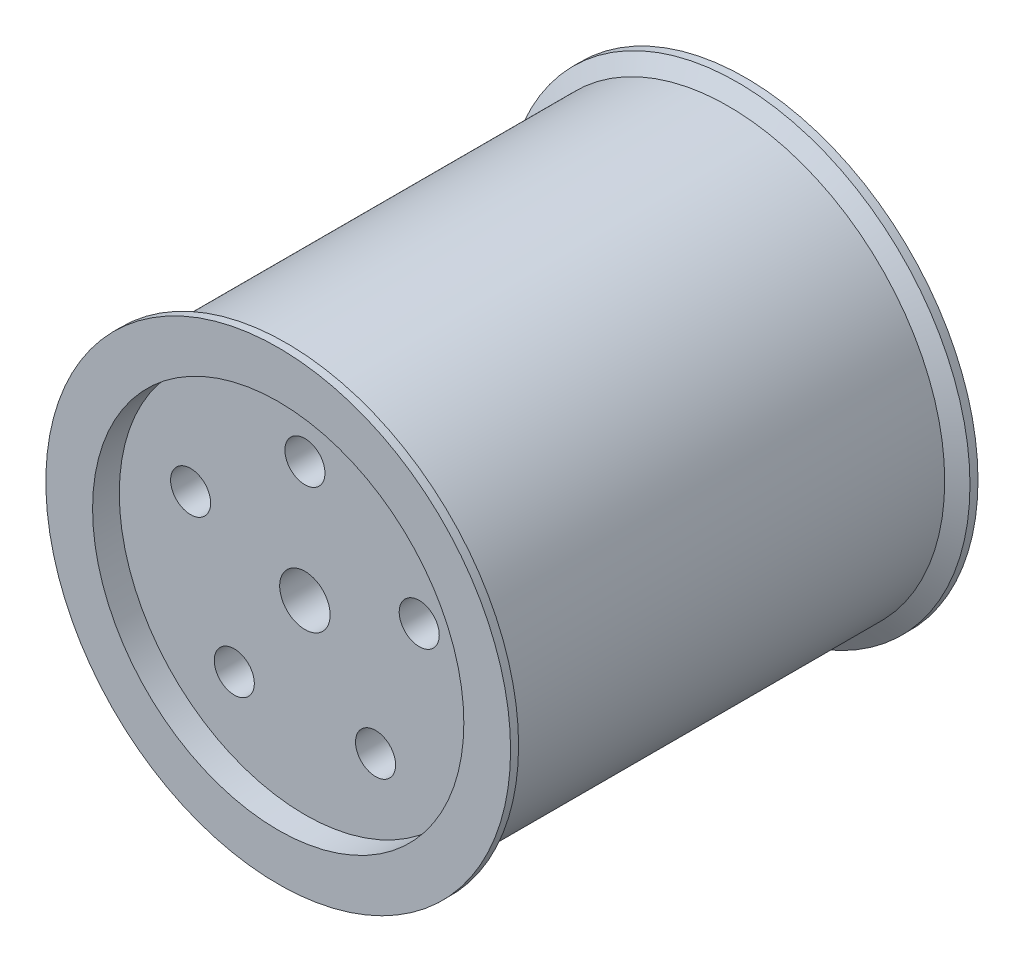
ISO-10303-21;
HEADER;
FILE_DESCRIPTION(('STEP AP214'),'2;1');
FILE_NAME('part.step','',(''),(''),'','','');
FILE_SCHEMA(('AUTOMOTIVE_DESIGN { 1 0 10303 214 1 1 1 1 }'));
ENDSEC;
DATA;
#1=APPLICATION_CONTEXT('core data for automotive mechanical design processes');
#2=APPLICATION_PROTOCOL_DEFINITION('international standard','automotive_design',2000,#1);
#3=PRODUCT_CONTEXT('',#1,'mechanical');
#4=PRODUCT('Part','Part','',(#3));
#5=PRODUCT_RELATED_PRODUCT_CATEGORY('part','',(#4));
#6=PRODUCT_DEFINITION_FORMATION('','',#4);
#7=PRODUCT_DEFINITION_CONTEXT('part definition',#1,'design');
#8=PRODUCT_DEFINITION('design','',#6,#7);
#9=PRODUCT_DEFINITION_SHAPE('','',#8);
#10=(LENGTH_UNIT() NAMED_UNIT(*) SI_UNIT(.MILLI.,.METRE.));
#11=(NAMED_UNIT(*) PLANE_ANGLE_UNIT() SI_UNIT($,.RADIAN.));
#12=(NAMED_UNIT(*) SI_UNIT($,.STERADIAN.) SOLID_ANGLE_UNIT());
#13=UNCERTAINTY_MEASURE_WITH_UNIT(LENGTH_MEASURE(1.E-05),#10,'distance_accuracy_value','');
#14=(GEOMETRIC_REPRESENTATION_CONTEXT(3) GLOBAL_UNCERTAINTY_ASSIGNED_CONTEXT((#13)) GLOBAL_UNIT_ASSIGNED_CONTEXT((#10,
#11,#12)) REPRESENTATION_CONTEXT('',''));
#15=CARTESIAN_POINT('',(0.,0.,0.));
#16=DIRECTION('',(0.,0.,1.));
#17=DIRECTION('',(1.,0.,0.));
#18=AXIS2_PLACEMENT_3D('',#15,#16,#17);
#19=CARTESIAN_POINT('',(0.,0.,87.5));
#20=DIRECTION('',(0.,0.,-1.));
#21=DIRECTION('',(-1.,0.,0.));
#22=AXIS2_PLACEMENT_3D('',#19,#20,#21);
#23=CYLINDRICAL_SURFACE('',#22,87.);
#24=CARTESIAN_POINT('',(0.,0.,-84.5));
#25=DIRECTION('',(0.,0.,1.));
#26=DIRECTION('',(1.,0.,0.));
#27=AXIS2_PLACEMENT_3D('',#24,#25,#26);
#28=CIRCLE('',#27,87.);
#29=CARTESIAN_POINT('',(87.,0.,-84.5));
#30=VERTEX_POINT('',#29);
#31=EDGE_CURVE('E95',#30,#30,#28,.T.);
#32=ORIENTED_EDGE('',*,*,#31,.F.);
#33=EDGE_LOOP('',(#32));
#34=FACE_BOUND('',#33,.T.);
#35=CARTESIAN_POINT('',(0.,0.,-87.5));
#36=DIRECTION('',(0.,0.,1.));
#37=DIRECTION('',(1.,0.,0.));
#38=AXIS2_PLACEMENT_3D('',#35,#36,#37);
#39=CIRCLE('',#38,87.);
#40=CARTESIAN_POINT('',(87.,0.,-87.5));
#41=VERTEX_POINT('',#40);
#42=EDGE_CURVE('E40',#41,#41,#39,.T.);
#43=ORIENTED_EDGE('',*,*,#42,.T.);
#44=EDGE_LOOP('',(#43));
#45=FACE_BOUND('',#44,.T.);
#46=ADVANCED_FACE('F32',(#34,#45),#23,.T.);
#47=CARTESIAN_POINT('',(0.,0.,-87.5));
#48=DIRECTION('',(0.,0.,1.));
#49=DIRECTION('',(1.,0.,0.));
#50=AXIS2_PLACEMENT_3D('',#47,#48,#49);
#51=CYLINDRICAL_SURFACE('',#50,9.4488);
#52=CARTESIAN_POINT('',(0.,0.,77.5));
#53=DIRECTION('',(0.,0.,1.));
#54=DIRECTION('',(1.,0.,0.));
#55=AXIS2_PLACEMENT_3D('',#52,#53,#54);
#56=CIRCLE('',#55,9.4488);
#57=CARTESIAN_POINT('',(9.4488,0.,77.5));
#58=VERTEX_POINT('',#57);
#59=EDGE_CURVE('E45',#58,#58,#56,.F.);
#60=ORIENTED_EDGE('',*,*,#59,.F.);
#61=EDGE_LOOP('',(#60));
#62=FACE_BOUND('',#61,.T.);
#63=CARTESIAN_POINT('',(0.,0.,-77.5));
#64=DIRECTION('',(0.,0.,-1.));
#65=DIRECTION('',(-1.,0.,0.));
#66=AXIS2_PLACEMENT_3D('',#63,#64,#65);
#67=CIRCLE('',#66,9.4488);
#68=CARTESIAN_POINT('',(-9.4488,0.,-77.5));
#69=VERTEX_POINT('',#68);
#70=EDGE_CURVE('E54',#69,#69,#67,.F.);
#71=ORIENTED_EDGE('',*,*,#70,.F.);
#72=EDGE_LOOP('',(#71));
#73=FACE_BOUND('',#72,.T.);
#74=ADVANCED_FACE('F120',(#62,#73),#51,.F.);
#75=CARTESIAN_POINT('',(0.,0.,84.5));
#76=DIRECTION('',(0.,0.,1.));
#77=DIRECTION('',(1.,0.,0.));
#78=AXIS2_PLACEMENT_3D('',#75,#76,#77);
#79=CIRCLE('',#78,87.);
#80=CARTESIAN_POINT('',(87.,0.,84.5));
#81=VERTEX_POINT('',#80);
#82=EDGE_CURVE('E61',#81,#81,#79,.T.);
#83=ORIENTED_EDGE('',*,*,#82,.T.);
#84=EDGE_LOOP('',(#83));
#85=FACE_BOUND('',#84,.T.);
#86=CARTESIAN_POINT('',(0.,0.,87.5));
#87=DIRECTION('',(0.,0.,1.));
#88=DIRECTION('',(1.,0.,0.));
#89=AXIS2_PLACEMENT_3D('',#86,#87,#88);
#90=CIRCLE('',#89,87.);
#91=CARTESIAN_POINT('',(87.,0.,87.5));
#92=VERTEX_POINT('',#91);
#93=EDGE_CURVE('E10',#92,#92,#90,.T.);
#94=ORIENTED_EDGE('',*,*,#93,.F.);
#95=EDGE_LOOP('',(#94));
#96=FACE_BOUND('',#95,.T.);
#97=ADVANCED_FACE('F34',(#85,#96),#23,.T.);
#98=CARTESIAN_POINT('',(0.,0.,87.5));
#99=DIRECTION('',(0.,0.,1.));
#100=DIRECTION('',(1.,0.,0.));
#101=AXIS2_PLACEMENT_3D('',#98,#99,#100);
#102=PLANE('',#101);
#103=CARTESIAN_POINT('',(0.,0.,87.5));
#104=DIRECTION('',(0.,0.,1.));
#105=DIRECTION('',(1.,0.,0.));
#106=AXIS2_PLACEMENT_3D('',#103,#104,#105);
#107=CIRCLE('',#106,69.5);
#108=CARTESIAN_POINT('',(69.5,0.,87.5));
#109=VERTEX_POINT('',#108);
#110=EDGE_CURVE('E48',#109,#109,#107,.T.);
#111=ORIENTED_EDGE('',*,*,#110,.F.);
#112=EDGE_LOOP('',(#111));
#113=FACE_BOUND('',#112,.T.);
#114=ORIENTED_EDGE('',*,*,#93,.T.);
#115=EDGE_LOOP('',(#114));
#116=FACE_BOUND('',#115,.T.);
#117=ADVANCED_FACE('F110',(#113,#116),#102,.T.);
#118=CARTESIAN_POINT('',(0.,0.,-87.5));
#119=DIRECTION('',(0.,0.,1.));
#120=DIRECTION('',(1.,0.,0.));
#121=AXIS2_PLACEMENT_3D('',#118,#119,#120);
#122=PLANE('',#121);
#123=CARTESIAN_POINT('',(0.,0.,-87.5));
#124=DIRECTION('',(0.,0.,1.));
#125=DIRECTION('',(1.,0.,0.));
#126=AXIS2_PLACEMENT_3D('',#123,#124,#125);
#127=CIRCLE('',#126,69.5);
#128=CARTESIAN_POINT('',(69.5,0.,-87.5));
#129=VERTEX_POINT('',#128);
#130=EDGE_CURVE('E98',#129,#129,#127,.T.);
#131=ORIENTED_EDGE('',*,*,#130,.T.);
#132=EDGE_LOOP('',(#131));
#133=FACE_BOUND('',#132,.T.);
#134=ORIENTED_EDGE('',*,*,#42,.F.);
#135=EDGE_LOOP('',(#134));
#136=FACE_BOUND('',#135,.T.);
#137=ADVANCED_FACE('F112',(#133,#136),#122,.F.);
#138=CARTESIAN_POINT('',(0.,0.,77.5));
#139=DIRECTION('',(0.,0.,1.));
#140=DIRECTION('',(1.,0.,0.));
#141=AXIS2_PLACEMENT_3D('',#138,#139,#140);
#142=PLANE('',#141);
#143=CARTESIAN_POINT('',(-26.4503363531611,-36.4057647468728,77.5));
#144=DIRECTION('',(0.,0.,1.));
#145=DIRECTION('',(-0.809016994374951,0.587785252292469,0.));
#146=AXIS2_PLACEMENT_3D('',#143,#144,#145);
#147=CIRCLE('',#146,7.5);
#148=CARTESIAN_POINT('',(-32.5179638109732,-31.9973753546793,77.5));
#149=VERTEX_POINT('',#148);
#150=EDGE_CURVE('E70',#149,#149,#147,.T.);
#151=ORIENTED_EDGE('',*,*,#150,.F.);
#152=EDGE_LOOP('',(#151));
#153=FACE_BOUND('',#152,.T.);
#154=CARTESIAN_POINT('',(26.4503363531616,-36.4057647468724,77.5));
#155=DIRECTION('',(0.,0.,1.));
#156=DIRECTION('',(-0.809016994374942,-0.58778525229248,0.));
#157=AXIS2_PLACEMENT_3D('',#154,#155,#156);
#158=CIRCLE('',#157,7.5);
#159=CARTESIAN_POINT('',(20.3827088953495,-40.814154139066,77.5));
#160=VERTEX_POINT('',#159);
#161=EDGE_CURVE('E272',#160,#160,#158,.T.);
#162=ORIENTED_EDGE('',*,*,#161,.F.);
#163=EDGE_LOOP('',(#162));
#164=FACE_BOUND('',#163,.T.);
#165=CARTESIAN_POINT('',(42.7975432332818,13.9057647468731,77.5));
#166=DIRECTION('',(0.,0.,1.));
#167=DIRECTION('',(0.309016994374958,-0.95105651629515,0.));
#168=AXIS2_PLACEMENT_3D('',#165,#166,#167);
#169=CIRCLE('',#168,7.5);
#170=CARTESIAN_POINT('',(45.1151706910939,6.77284087465949,77.5));
#171=VERTEX_POINT('',#170);
#172=EDGE_CURVE('E83',#171,#171,#169,.T.);
#173=ORIENTED_EDGE('',*,*,#172,.F.);
#174=EDGE_LOOP('',(#173));
#175=FACE_BOUND('',#174,.T.);
#176=CARTESIAN_POINT('',(-42.797543233282,13.9057647468725,77.5));
#177=DIRECTION('',(0.,0.,1.));
#178=DIRECTION('',(0.309016994374945,0.951056516295155,0.));
#179=AXIS2_PLACEMENT_3D('',#176,#177,#178);
#180=CIRCLE('',#179,7.5);
#181=CARTESIAN_POINT('',(-40.4799157754699,21.0386886190862,77.5));
#182=VERTEX_POINT('',#181);
#183=EDGE_CURVE('E66',#182,#182,#180,.T.);
#184=ORIENTED_EDGE('',*,*,#183,.F.);
#185=EDGE_LOOP('',(#184));
#186=FACE_BOUND('',#185,.T.);
#187=CARTESIAN_POINT('',(0.,45.,77.5));
#188=DIRECTION('',(0.,0.,1.));
#189=DIRECTION('',(1.,0.,0.));
#190=AXIS2_PLACEMENT_3D('',#187,#188,#189);
#191=CIRCLE('',#190,7.5);
#192=CARTESIAN_POINT('',(7.5,45.,77.5));
#193=VERTEX_POINT('',#192);
#194=EDGE_CURVE('E62',#193,#193,#191,.T.);
#195=ORIENTED_EDGE('',*,*,#194,.F.);
#196=EDGE_LOOP('',(#195));
#197=FACE_BOUND('',#196,.T.);
#198=CARTESIAN_POINT('',(0.,0.,77.5));
#199=DIRECTION('',(0.,0.,1.));
#200=DIRECTION('',(1.,0.,0.));
#201=AXIS2_PLACEMENT_3D('',#198,#199,#200);
#202=CIRCLE('',#201,69.5);
#203=CARTESIAN_POINT('',(69.5,0.,77.5));
#204=VERTEX_POINT('',#203);
#205=EDGE_CURVE('E53',#204,#204,#202,.T.);
#206=ORIENTED_EDGE('',*,*,#205,.T.);
#207=EDGE_LOOP('',(#206));
#208=FACE_BOUND('',#207,.T.);
#209=ORIENTED_EDGE('',*,*,#59,.T.);
#210=EDGE_LOOP('',(#209));
#211=FACE_BOUND('',#210,.T.);
#212=ADVANCED_FACE('F118',(#153,#164,#175,#186,#197,#208,#211),#142,.T.);
#213=CARTESIAN_POINT('',(0.,0.,77.5));
#214=DIRECTION('',(0.,0.,1.));
#215=DIRECTION('',(1.,0.,0.));
#216=AXIS2_PLACEMENT_3D('',#213,#214,#215);
#217=CYLINDRICAL_SURFACE('',#216,69.5);
#218=ORIENTED_EDGE('',*,*,#205,.F.);
#219=EDGE_LOOP('',(#218));
#220=FACE_BOUND('',#219,.T.);
#221=ORIENTED_EDGE('',*,*,#110,.T.);
#222=EDGE_LOOP('',(#221));
#223=FACE_BOUND('',#222,.T.);
#224=ADVANCED_FACE('F108',(#220,#223),#217,.F.);
#225=CARTESIAN_POINT('',(0.,0.,-77.5));
#226=DIRECTION('',(0.,0.,-1.));
#227=DIRECTION('',(1.,0.,0.));
#228=AXIS2_PLACEMENT_3D('',#225,#226,#227);
#229=PLANE('',#228);
#230=CARTESIAN_POINT('',(-26.4503363531611,-36.4057647468728,-77.5));
#231=DIRECTION('',(0.,0.,-1.));
#232=DIRECTION('',(-1.,0.,0.));
#233=AXIS2_PLACEMENT_3D('',#230,#231,#232);
#234=CIRCLE('',#233,7.5);
#235=CARTESIAN_POINT('',(-33.9503363531611,-36.4057647468728,-77.5));
#236=VERTEX_POINT('',#235);
#237=EDGE_CURVE('E36',#236,#236,#234,.T.);
#238=ORIENTED_EDGE('',*,*,#237,.F.);
#239=EDGE_LOOP('',(#238));
#240=FACE_BOUND('',#239,.T.);
#241=CARTESIAN_POINT('',(26.4503363531616,-36.4057647468724,-77.5));
#242=DIRECTION('',(0.,0.,-1.));
#243=DIRECTION('',(-1.,0.,0.));
#244=AXIS2_PLACEMENT_3D('',#241,#242,#243);
#245=CIRCLE('',#244,7.5);
#246=CARTESIAN_POINT('',(18.9503363531616,-36.4057647468724,-77.5));
#247=VERTEX_POINT('',#246);
#248=EDGE_CURVE('E69',#247,#247,#245,.T.);
#249=ORIENTED_EDGE('',*,*,#248,.F.);
#250=EDGE_LOOP('',(#249));
#251=FACE_BOUND('',#250,.T.);
#252=CARTESIAN_POINT('',(42.7975432332818,13.9057647468731,-77.5));
#253=DIRECTION('',(0.,0.,-1.));
#254=DIRECTION('',(-1.,0.,0.));
#255=AXIS2_PLACEMENT_3D('',#252,#253,#254);
#256=CIRCLE('',#255,7.5);
#257=CARTESIAN_POINT('',(35.2975432332818,13.9057647468731,-77.5));
#258=VERTEX_POINT('',#257);
#259=EDGE_CURVE('E67',#258,#258,#256,.T.);
#260=ORIENTED_EDGE('',*,*,#259,.F.);
#261=EDGE_LOOP('',(#260));
#262=FACE_BOUND('',#261,.T.);
#263=CARTESIAN_POINT('',(-42.797543233282,13.9057647468725,-77.5));
#264=DIRECTION('',(0.,0.,-1.));
#265=DIRECTION('',(-1.,0.,0.));
#266=AXIS2_PLACEMENT_3D('',#263,#264,#265);
#267=CIRCLE('',#266,7.5);
#268=CARTESIAN_POINT('',(-50.297543233282,13.9057647468725,-77.5));
#269=VERTEX_POINT('',#268);
#270=EDGE_CURVE('E63',#269,#269,#267,.T.);
#271=ORIENTED_EDGE('',*,*,#270,.F.);
#272=EDGE_LOOP('',(#271));
#273=FACE_BOUND('',#272,.T.);
#274=CARTESIAN_POINT('',(0.,45.,-77.5));
#275=DIRECTION('',(0.,0.,-1.));
#276=DIRECTION('',(-1.,0.,0.));
#277=AXIS2_PLACEMENT_3D('',#274,#275,#276);
#278=CIRCLE('',#277,7.5);
#279=CARTESIAN_POINT('',(-7.5,45.,-77.5));
#280=VERTEX_POINT('',#279);
#281=EDGE_CURVE('E58',#280,#280,#278,.T.);
#282=ORIENTED_EDGE('',*,*,#281,.F.);
#283=EDGE_LOOP('',(#282));
#284=FACE_BOUND('',#283,.T.);
#285=CARTESIAN_POINT('',(0.,0.,-77.5));
#286=DIRECTION('',(0.,0.,1.));
#287=DIRECTION('',(1.,0.,0.));
#288=AXIS2_PLACEMENT_3D('',#285,#286,#287);
#289=CIRCLE('',#288,69.5);
#290=CARTESIAN_POINT('',(69.5,0.,-77.5));
#291=VERTEX_POINT('',#290);
#292=EDGE_CURVE('E57',#291,#291,#289,.T.);
#293=ORIENTED_EDGE('',*,*,#292,.F.);
#294=EDGE_LOOP('',(#293));
#295=FACE_BOUND('',#294,.T.);
#296=ORIENTED_EDGE('',*,*,#70,.T.);
#297=EDGE_LOOP('',(#296));
#298=FACE_BOUND('',#297,.T.);
#299=ADVANCED_FACE('F147',(#240,#251,#262,#273,#284,#295,#298),#229,.T.);
#300=CARTESIAN_POINT('',(0.,0.,-77.5));
#301=DIRECTION('',(0.,0.,-1.));
#302=DIRECTION('',(-1.,0.,0.));
#303=AXIS2_PLACEMENT_3D('',#300,#301,#302);
#304=CYLINDRICAL_SURFACE('',#303,69.5);
#305=ORIENTED_EDGE('',*,*,#292,.T.);
#306=EDGE_LOOP('',(#305));
#307=FACE_BOUND('',#306,.T.);
#308=ORIENTED_EDGE('',*,*,#130,.F.);
#309=EDGE_LOOP('',(#308));
#310=FACE_BOUND('',#309,.T.);
#311=ADVANCED_FACE('F137',(#307,#310),#304,.F.);
#312=CARTESIAN_POINT('',(0.,0.,-84.5));
#313=DIRECTION('',(0.,0.,-1.));
#314=DIRECTION('',(-1.,0.,0.));
#315=AXIS2_PLACEMENT_3D('',#312,#313,#314);
#316=CONICAL_SURFACE('',#315,87.,1.0471975511966);
#317=CARTESIAN_POINT('',(0.,0.,-81.0358983848623));
#318=DIRECTION('',(0.,0.,1.));
#319=DIRECTION('',(1.,0.,0.));
#320=AXIS2_PLACEMENT_3D('',#317,#318,#319);
#321=CIRCLE('',#320,81.);
#322=CARTESIAN_POINT('',(81.,0.,-81.0358983848623));
#323=VERTEX_POINT('',#322);
#324=EDGE_CURVE('E92',#323,#323,#321,.T.);
#325=ORIENTED_EDGE('',*,*,#324,.F.);
#326=EDGE_LOOP('',(#325));
#327=FACE_BOUND('',#326,.T.);
#328=ORIENTED_EDGE('',*,*,#31,.T.);
#329=EDGE_LOOP('',(#328));
#330=FACE_BOUND('',#329,.T.);
#331=ADVANCED_FACE('F134',(#327,#330),#316,.T.);
#332=CARTESIAN_POINT('',(0.,0.,0.));
#333=DIRECTION('',(0.,0.,1.));
#334=DIRECTION('',(1.,0.,0.));
#335=AXIS2_PLACEMENT_3D('',#332,#333,#334);
#336=CYLINDRICAL_SURFACE('',#335,81.);
#337=CARTESIAN_POINT('',(0.,0.,81.0358983848623));
#338=DIRECTION('',(0.,0.,1.));
#339=DIRECTION('',(1.,0.,0.));
#340=AXIS2_PLACEMENT_3D('',#337,#338,#339);
#341=CIRCLE('',#340,81.);
#342=CARTESIAN_POINT('',(81.,0.,81.0358983848623));
#343=VERTEX_POINT('',#342);
#344=EDGE_CURVE('E89',#343,#343,#341,.T.);
#345=ORIENTED_EDGE('',*,*,#344,.F.);
#346=EDGE_LOOP('',(#345));
#347=FACE_BOUND('',#346,.T.);
#348=ORIENTED_EDGE('',*,*,#324,.T.);
#349=EDGE_LOOP('',(#348));
#350=FACE_BOUND('',#349,.T.);
#351=ADVANCED_FACE('F136',(#347,#350),#336,.T.);
#352=CARTESIAN_POINT('',(0.,0.,81.0358983848623));
#353=DIRECTION('',(0.,0.,1.));
#354=DIRECTION('',(1.,0.,0.));
#355=AXIS2_PLACEMENT_3D('',#352,#353,#354);
#356=CONICAL_SURFACE('',#355,81.,1.0471975511966);
#357=ORIENTED_EDGE('',*,*,#82,.F.);
#358=EDGE_LOOP('',(#357));
#359=FACE_BOUND('',#358,.T.);
#360=ORIENTED_EDGE('',*,*,#344,.T.);
#361=EDGE_LOOP('',(#360));
#362=FACE_BOUND('',#361,.T.);
#363=ADVANCED_FACE('F144',(#359,#362),#356,.T.);
#364=CARTESIAN_POINT('',(0.,45.,-87.5));
#365=DIRECTION('',(0.,0.,1.));
#366=DIRECTION('',(1.,0.,0.));
#367=AXIS2_PLACEMENT_3D('',#364,#365,#366);
#368=CYLINDRICAL_SURFACE('',#367,7.5);
#369=ORIENTED_EDGE('',*,*,#281,.T.);
#370=EDGE_LOOP('',(#369));
#371=FACE_BOUND('',#370,.T.);
#372=ORIENTED_EDGE('',*,*,#194,.T.);
#373=EDGE_LOOP('',(#372));
#374=FACE_BOUND('',#373,.T.);
#375=ADVANCED_FACE('F210',(#371,#374),#368,.F.);
#376=CARTESIAN_POINT('',(-42.797543233282,13.9057647468725,-87.5));
#377=DIRECTION('',(0.,0.,1.));
#378=DIRECTION('',(1.,0.,0.));
#379=AXIS2_PLACEMENT_3D('',#376,#377,#378);
#380=CYLINDRICAL_SURFACE('',#379,7.5);
#381=ORIENTED_EDGE('',*,*,#270,.T.);
#382=EDGE_LOOP('',(#381));
#383=FACE_BOUND('',#382,.T.);
#384=ORIENTED_EDGE('',*,*,#183,.T.);
#385=EDGE_LOOP('',(#384));
#386=FACE_BOUND('',#385,.T.);
#387=ADVANCED_FACE('F218',(#383,#386),#380,.F.);
#388=CARTESIAN_POINT('',(42.7975432332818,13.9057647468731,-87.5));
#389=DIRECTION('',(0.,0.,1.));
#390=DIRECTION('',(1.,0.,0.));
#391=AXIS2_PLACEMENT_3D('',#388,#389,#390);
#392=CYLINDRICAL_SURFACE('',#391,7.5);
#393=ORIENTED_EDGE('',*,*,#259,.T.);
#394=EDGE_LOOP('',(#393));
#395=FACE_BOUND('',#394,.T.);
#396=ORIENTED_EDGE('',*,*,#172,.T.);
#397=EDGE_LOOP('',(#396));
#398=FACE_BOUND('',#397,.T.);
#399=ADVANCED_FACE('F237',(#395,#398),#392,.F.);
#400=CARTESIAN_POINT('',(26.4503363531616,-36.4057647468724,-87.5));
#401=DIRECTION('',(0.,0.,1.));
#402=DIRECTION('',(1.,0.,0.));
#403=AXIS2_PLACEMENT_3D('',#400,#401,#402);
#404=CYLINDRICAL_SURFACE('',#403,7.5);
#405=ORIENTED_EDGE('',*,*,#248,.T.);
#406=EDGE_LOOP('',(#405));
#407=FACE_BOUND('',#406,.T.);
#408=ORIENTED_EDGE('',*,*,#161,.T.);
#409=EDGE_LOOP('',(#408));
#410=FACE_BOUND('',#409,.T.);
#411=ADVANCED_FACE('F247',(#407,#410),#404,.F.);
#412=CARTESIAN_POINT('',(-26.4503363531611,-36.4057647468728,-87.5));
#413=DIRECTION('',(0.,0.,1.));
#414=DIRECTION('',(1.,0.,0.));
#415=AXIS2_PLACEMENT_3D('',#412,#413,#414);
#416=CYLINDRICAL_SURFACE('',#415,7.5);
#417=ORIENTED_EDGE('',*,*,#237,.T.);
#418=EDGE_LOOP('',(#417));
#419=FACE_BOUND('',#418,.T.);
#420=ORIENTED_EDGE('',*,*,#150,.T.);
#421=EDGE_LOOP('',(#420));
#422=FACE_BOUND('',#421,.T.);
#423=ADVANCED_FACE('F257',(#419,#422),#416,.F.);
#424=CLOSED_SHELL('',(#46,#74,#97,#117,#137,#212,#224,#299,#311,#331,#351,#363,#375,#387,#399,
#411,#423));
#425=MANIFOLD_SOLID_BREP('B2',#424);
#426=ADVANCED_BREP_SHAPE_REPRESENTATION('',(#18,#425),#14);
#427=SHAPE_DEFINITION_REPRESENTATION(#9,#426);
ENDSEC;
END-ISO-10303-21;
